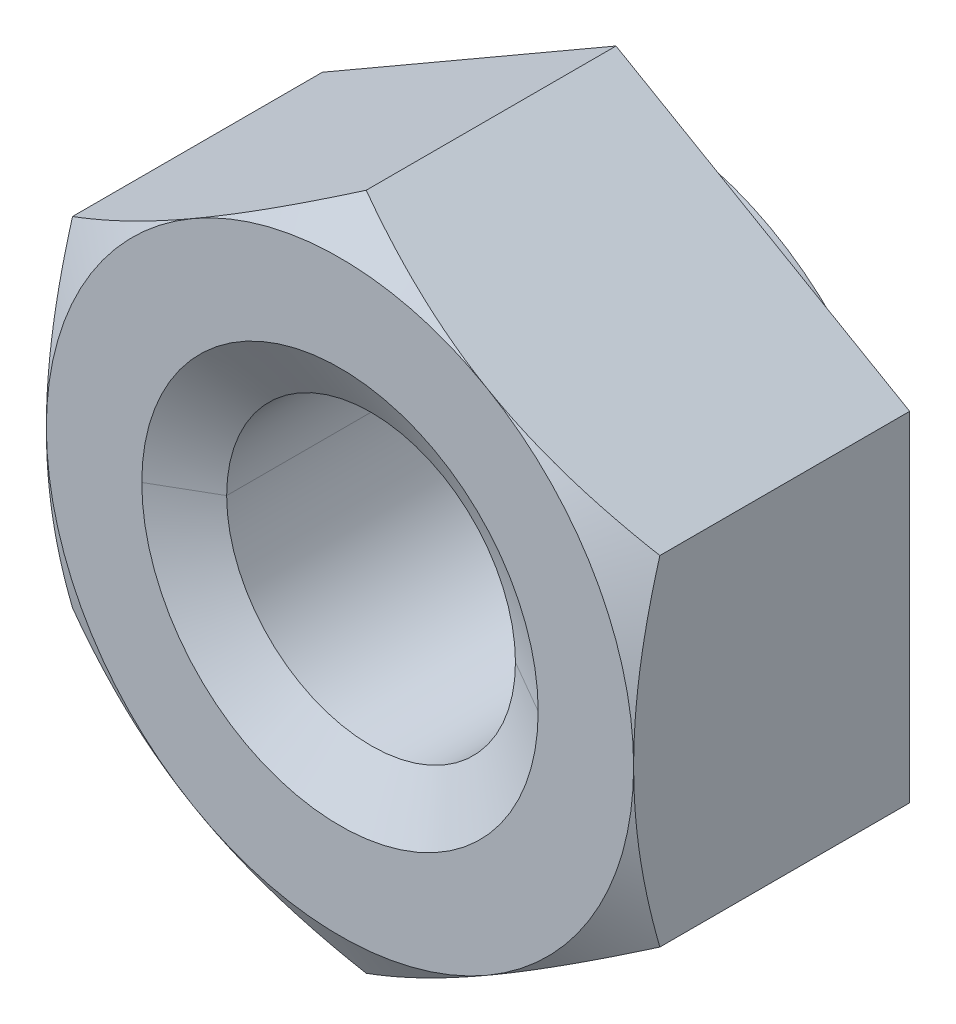
ISO-10303-21;
HEADER;
FILE_DESCRIPTION(('STEP AP214'),'2;1');
FILE_NAME('part.step','',(''),(''),'','','');
FILE_SCHEMA(('AUTOMOTIVE_DESIGN { 1 0 10303 214 1 1 1 1 }'));
ENDSEC;
DATA;
#1=APPLICATION_CONTEXT('core data for automotive mechanical design processes');
#2=APPLICATION_PROTOCOL_DEFINITION('international standard','automotive_design',2000,#1);
#3=PRODUCT_CONTEXT('',#1,'mechanical');
#4=PRODUCT('Part','Part','',(#3));
#5=PRODUCT_RELATED_PRODUCT_CATEGORY('part','',(#4));
#6=PRODUCT_DEFINITION_FORMATION('','',#4);
#7=PRODUCT_DEFINITION_CONTEXT('part definition',#1,'design');
#8=PRODUCT_DEFINITION('design','',#6,#7);
#9=PRODUCT_DEFINITION_SHAPE('','',#8);
#10=(LENGTH_UNIT() NAMED_UNIT(*) SI_UNIT(.MILLI.,.METRE.));
#11=(NAMED_UNIT(*) PLANE_ANGLE_UNIT() SI_UNIT($,.RADIAN.));
#12=(NAMED_UNIT(*) SI_UNIT($,.STERADIAN.) SOLID_ANGLE_UNIT());
#13=UNCERTAINTY_MEASURE_WITH_UNIT(LENGTH_MEASURE(1.E-05),#10,'distance_accuracy_value','');
#14=(GEOMETRIC_REPRESENTATION_CONTEXT(3) GLOBAL_UNCERTAINTY_ASSIGNED_CONTEXT((#13)) GLOBAL_UNIT_ASSIGNED_CONTEXT((#10,
#11,#12)) REPRESENTATION_CONTEXT('',''));
#15=CARTESIAN_POINT('',(0.,0.,0.));
#16=DIRECTION('',(0.,0.,1.));
#17=DIRECTION('',(1.,0.,0.));
#18=AXIS2_PLACEMENT_3D('',#15,#16,#17);
#19=CARTESIAN_POINT('',(0.,-4.45,-4.7));
#20=DIRECTION('',(0.,0.,-1.));
#21=DIRECTION('',(0.,-1.,0.));
#22=AXIS2_PLACEMENT_3D('',#19,#20,#21);
#23=PLANE('',#22);
#24=CARTESIAN_POINT('',(0.,0.,-4.7));
#25=DIRECTION('',(0.,0.,1.));
#26=DIRECTION('',(1.,0.,0.));
#27=AXIS2_PLACEMENT_3D('',#24,#25,#26);
#28=CIRCLE('',#27,4.45);
#29=CARTESIAN_POINT('',(4.45,0.,-4.7));
#30=VERTEX_POINT('',#29);
#31=CARTESIAN_POINT('',(-4.45,0.,-4.7));
#32=VERTEX_POINT('',#31);
#33=EDGE_CURVE('E336',#30,#32,#28,.T.);
#34=ORIENTED_EDGE('',*,*,#33,.T.);
#35=CARTESIAN_POINT('',(0.,0.,-4.7));
#36=DIRECTION('',(0.,0.,1.));
#37=DIRECTION('',(1.,0.,0.));
#38=AXIS2_PLACEMENT_3D('',#35,#36,#37);
#39=CIRCLE('',#38,4.45);
#40=EDGE_CURVE('E11',#32,#30,#39,.T.);
#41=ORIENTED_EDGE('',*,*,#40,.T.);
#42=EDGE_LOOP('',(#34,#41));
#43=FACE_BOUND('',#42,.T.);
#44=DIRECTION('',(0.,1.,0.));
#45=VECTOR('',#44,1.);
#46=CARTESIAN_POINT('',(5.,-2.8867513459481,-4.7));
#47=LINE('',#46,#45);
#48=CARTESIAN_POINT('',(5.00000000000006,-2.88675134594807,-4.7));
#49=VERTEX_POINT('',#48);
#50=CARTESIAN_POINT('',(5.,2.88675134594817,-4.7));
#51=VERTEX_POINT('',#50);
#52=EDGE_CURVE('E503',#49,#51,#47,.T.);
#53=ORIENTED_EDGE('',*,*,#52,.F.);
#54=DIRECTION('',(0.866025403784439,0.5,0.));
#55=VECTOR('',#54,1.);
#56=CARTESIAN_POINT('',(0.,-5.77350269189623,-4.7));
#57=LINE('',#56,#55);
#58=CARTESIAN_POINT('',(0.,-5.77350269189628,-4.7));
#59=VERTEX_POINT('',#58);
#60=EDGE_CURVE('E204',#59,#49,#57,.T.);
#61=ORIENTED_EDGE('',*,*,#60,.F.);
#62=DIRECTION('',(0.866025403784439,-0.5,0.));
#63=VECTOR('',#62,1.);
#64=CARTESIAN_POINT('',(-5.,-2.8867513459481,-4.7));
#65=LINE('',#64,#63);
#66=CARTESIAN_POINT('',(-5.,-2.88675134594819,-4.7));
#67=VERTEX_POINT('',#66);
#68=EDGE_CURVE('E300',#67,#59,#65,.T.);
#69=ORIENTED_EDGE('',*,*,#68,.F.);
#70=DIRECTION('',(0.,-1.,0.));
#71=VECTOR('',#70,1.);
#72=CARTESIAN_POINT('',(-5.,2.88675134594815,-4.7));
#73=LINE('',#72,#71);
#74=CARTESIAN_POINT('',(-5.,2.88675134594815,-4.7));
#75=VERTEX_POINT('',#74);
#76=EDGE_CURVE('E143',#75,#67,#73,.T.);
#77=ORIENTED_EDGE('',*,*,#76,.F.);
#78=DIRECTION('',(-0.866025403784439,-0.5,0.));
#79=VECTOR('',#78,1.);
#80=CARTESIAN_POINT('',(0.,5.77350269189628,-4.7));
#81=LINE('',#80,#79);
#82=CARTESIAN_POINT('',(0.,5.77350269189628,-4.7));
#83=VERTEX_POINT('',#82);
#84=EDGE_CURVE('E475',#83,#75,#81,.T.);
#85=ORIENTED_EDGE('',*,*,#84,.F.);
#86=DIRECTION('',(-0.866025403784439,0.5,0.));
#87=VECTOR('',#86,1.);
#88=CARTESIAN_POINT('',(5.,2.88675134594815,-4.7));
#89=LINE('',#88,#87);
#90=EDGE_CURVE('E326',#51,#83,#89,.T.);
#91=ORIENTED_EDGE('',*,*,#90,.F.);
#92=EDGE_LOOP('',(#53,#61,#69,#77,#85,#91));
#93=FACE_BOUND('',#92,.T.);
#94=ADVANCED_FACE('F17',(#43,#93),#23,.T.);
#95=CARTESIAN_POINT('',(0.,0.,0.));
#96=DIRECTION('',(0.,0.,1.));
#97=DIRECTION('',(1.,0.,0.));
#98=AXIS2_PLACEMENT_3D('',#95,#96,#97);
#99=CYLINDRICAL_SURFACE('',#98,4.45);
#100=DIRECTION('',(0.,0.,1.));
#101=VECTOR('',#100,1.);
#102=CARTESIAN_POINT('',(-4.45,0.,0.));
#103=LINE('',#102,#101);
#104=CARTESIAN_POINT('',(-4.45,0.,-5.2));
#105=VERTEX_POINT('',#104);
#106=EDGE_CURVE('E322',#105,#32,#103,.T.);
#107=ORIENTED_EDGE('',*,*,#106,.F.);
#108=CARTESIAN_POINT('',(0.,0.,-5.2));
#109=DIRECTION('',(0.,0.,1.));
#110=DIRECTION('',(1.,0.,0.));
#111=AXIS2_PLACEMENT_3D('',#108,#109,#110);
#112=CIRCLE('',#111,4.45);
#113=CARTESIAN_POINT('',(4.45,0.,-5.2));
#114=VERTEX_POINT('',#113);
#115=EDGE_CURVE('E95',#105,#114,#112,.T.);
#116=ORIENTED_EDGE('',*,*,#115,.T.);
#117=DIRECTION('',(0.,0.,1.));
#118=VECTOR('',#117,1.);
#119=CARTESIAN_POINT('',(4.45,0.,0.));
#120=LINE('',#119,#118);
#121=EDGE_CURVE('E332',#114,#30,#120,.T.);
#122=ORIENTED_EDGE('',*,*,#121,.T.);
#123=ORIENTED_EDGE('',*,*,#40,.F.);
#124=EDGE_LOOP('',(#107,#116,#122,#123));
#125=FACE_BOUND('',#124,.T.);
#126=ADVANCED_FACE('F397',(#125),#99,.T.);
#127=CARTESIAN_POINT('',(0.,0.,0.));
#128=DIRECTION('',(0.,0.,-1.));
#129=DIRECTION('',(1.,0.,0.));
#130=AXIS2_PLACEMENT_3D('',#127,#128,#129);
#131=CONICAL_SURFACE('',#130,5.,1.0471975511966);
#132=CARTESIAN_POINT('',(0.,0.,0.));
#133=DIRECTION('',(0.,0.,1.));
#134=DIRECTION('',(1.,0.,0.));
#135=AXIS2_PLACEMENT_3D('',#132,#133,#134);
#136=CIRCLE('',#135,5.);
#137=CARTESIAN_POINT('',(5.,0.,0.));
#138=VERTEX_POINT('',#137);
#139=CARTESIAN_POINT('',(2.5,4.33012701892222,0.));
#140=VERTEX_POINT('',#139);
#141=EDGE_CURVE('E180',#138,#140,#136,.T.);
#142=ORIENTED_EDGE('',*,*,#141,.F.);
#143=CARTESIAN_POINT('',(5.,2.88675134594815,-0.44658198738521));
#144=CARTESIAN_POINT('',(5.,2.13978985190511,-0.23095277755519));
#145=CARTESIAN_POINT('',(5.,1.4651498699089,-0.12138562684716));
#146=CARTESIAN_POINT('',(5.,0.717739751259445,0.));
#147=CARTESIAN_POINT('',(5.,0.,0.));
#148=B_SPLINE_CURVE_WITH_KNOTS('',2,(#143,#144,#145,#146,#147),.UNSPECIFIED.,.F.,.F.,(3,2,3),
(0.,0.5,1.),.UNSPECIFIED.);
#149=CARTESIAN_POINT('',(5.,2.88675134594815,-0.446581987385213));
#150=VERTEX_POINT('',#149);
#151=EDGE_CURVE('E506',#150,#138,#148,.T.);
#152=ORIENTED_EDGE('',*,*,#151,.F.);
#153=CARTESIAN_POINT('',(2.50000000000001,4.33012701892221,0.));
#154=CARTESIAN_POINT('',(3.11905581577512,3.97271497704105,0.));
#155=CARTESIAN_POINT('',(3.7644115070673,3.60011869495045,-0.12055357220658));
#156=CARTESIAN_POINT('',(4.35018566971069,3.26192182446397,-0.22997721062151));
#157=CARTESIAN_POINT('',(5.,2.88675134594815,-0.44658198738521));
#158=B_SPLINE_CURVE_WITH_KNOTS('',2,(#153,#154,#155,#156,#157),.UNSPECIFIED.,.F.,.F.,(3,2,3),
(0.,0.5,1.),.UNSPECIFIED.);
#159=EDGE_CURVE('E515',#140,#150,#158,.T.);
#160=ORIENTED_EDGE('',*,*,#159,.F.);
#161=EDGE_LOOP('',(#142,#152,#160));
#162=FACE_BOUND('',#161,.T.);
#163=ADVANCED_FACE('F395',(#162),#131,.T.);
#164=CARTESIAN_POINT('',(0.,0.,0.));
#165=DIRECTION('',(0.,0.,-1.));
#166=DIRECTION('',(1.,0.,0.));
#167=AXIS2_PLACEMENT_3D('',#164,#165,#166);
#168=CONICAL_SURFACE('',#167,5.,1.0471975511966);
#169=CARTESIAN_POINT('',(0.,0.,0.));
#170=DIRECTION('',(0.,0.,1.));
#171=DIRECTION('',(1.,0.,0.));
#172=AXIS2_PLACEMENT_3D('',#169,#170,#171);
#173=CIRCLE('',#172,5.);
#174=CARTESIAN_POINT('',(2.5,-4.33012701892217,0.));
#175=VERTEX_POINT('',#174);
#176=EDGE_CURVE('E160',#175,#138,#173,.T.);
#177=ORIENTED_EDGE('',*,*,#176,.F.);
#178=CARTESIAN_POINT('',(5.00000000000001,-2.8867513459481,-0.44658198738519));
#179=CARTESIAN_POINT('',(3.66025403784801,-3.66025403784227,0.));
#180=CARTESIAN_POINT('',(2.49999999999999,-4.33012701892217,0.));
#181=B_SPLINE_CURVE_WITH_KNOTS('',2,(#178,#179,#180),.UNSPECIFIED.,.F.,.F.,(3,3),(0.,1.),.UNSPECIFIED.);
#182=CARTESIAN_POINT('',(5.,-2.8867513459481,-0.446581987385198));
#183=VERTEX_POINT('',#182);
#184=EDGE_CURVE('E173',#183,#175,#181,.T.);
#185=ORIENTED_EDGE('',*,*,#184,.F.);
#186=CARTESIAN_POINT('',(5.,0.,0.));
#187=CARTESIAN_POINT('',(5.,-0.712205067236649,0.));
#188=CARTESIAN_POINT('',(5.,-1.45445474002716,-0.11965506873743));
#189=CARTESIAN_POINT('',(5.,-2.13337570264538,-0.2291011721543));
#190=CARTESIAN_POINT('',(5.,-2.8867513459481,-0.44658198738519));
#191=B_SPLINE_CURVE_WITH_KNOTS('',2,(#186,#187,#188,#189,#190),.UNSPECIFIED.,.F.,.F.,(3,2,3),
(0.,0.5,1.),.UNSPECIFIED.);
#192=EDGE_CURVE('E176',#138,#183,#191,.T.);
#193=ORIENTED_EDGE('',*,*,#192,.F.);
#194=EDGE_LOOP('',(#177,#185,#193));
#195=FACE_BOUND('',#194,.T.);
#196=ADVANCED_FACE('F171',(#195),#168,.T.);
#197=CARTESIAN_POINT('',(0.,0.,0.));
#198=DIRECTION('',(0.,0.,-1.));
#199=DIRECTION('',(1.,0.,0.));
#200=AXIS2_PLACEMENT_3D('',#197,#198,#199);
#201=CONICAL_SURFACE('',#200,5.,1.0471975511966);
#202=CARTESIAN_POINT('',(0.,0.,0.));
#203=DIRECTION('',(0.,0.,1.));
#204=DIRECTION('',(1.,0.,0.));
#205=AXIS2_PLACEMENT_3D('',#202,#203,#204);
#206=CIRCLE('',#205,5.);
#207=CARTESIAN_POINT('',(-2.5,-4.33012701892217,0.));
#208=VERTEX_POINT('',#207);
#209=EDGE_CURVE('E155',#208,#175,#206,.T.);
#210=ORIENTED_EDGE('',*,*,#209,.F.);
#211=CARTESIAN_POINT('',(0.,-5.77350269189623,-0.446581987385188));
#212=CARTESIAN_POINT('',(-1.33974596215199,-5.00000000000207,0.));
#213=CARTESIAN_POINT('',(-2.49999999999999,-4.33012701892217,0.));
#214=B_SPLINE_CURVE_WITH_KNOTS('',2,(#211,#212,#213),.UNSPECIFIED.,.F.,.F.,(3,3),(0.,1.),.UNSPECIFIED.);
#215=CARTESIAN_POINT('',(0.,-5.77350269189623,-0.446581987385191));
#216=VERTEX_POINT('',#215);
#217=EDGE_CURVE('E188',#216,#208,#214,.T.);
#218=ORIENTED_EDGE('',*,*,#217,.F.);
#219=CARTESIAN_POINT('',(2.49999999999999,-4.33012701892217,0.));
#220=CARTESIAN_POINT('',(1.88094418422114,-4.68753906080549,0.));
#221=CARTESIAN_POINT('',(1.2355884929327,-5.06013534289393,-0.12055357220655));
#222=CARTESIAN_POINT('',(0.649814330285145,-5.39833221338283,-0.22997721062288));
#223=CARTESIAN_POINT('',(0.,-5.77350269189623,-0.44658198738519));
#224=B_SPLINE_CURVE_WITH_KNOTS('',2,(#219,#220,#221,#222,#223),.UNSPECIFIED.,.F.,.F.,(3,2,3),
(0.,0.5,1.),.UNSPECIFIED.);
#225=EDGE_CURVE('E184',#175,#216,#224,.T.);
#226=ORIENTED_EDGE('',*,*,#225,.F.);
#227=EDGE_LOOP('',(#210,#218,#226));
#228=FACE_BOUND('',#227,.T.);
#229=ADVANCED_FACE('F186',(#228),#201,.T.);
#230=CARTESIAN_POINT('',(0.,0.,0.));
#231=DIRECTION('',(0.,0.,-1.));
#232=DIRECTION('',(1.,0.,0.));
#233=AXIS2_PLACEMENT_3D('',#230,#231,#232);
#234=CONICAL_SURFACE('',#233,5.,1.0471975511966);
#235=CARTESIAN_POINT('',(0.,0.,0.));
#236=DIRECTION('',(0.,0.,1.));
#237=DIRECTION('',(1.,0.,0.));
#238=AXIS2_PLACEMENT_3D('',#235,#236,#237);
#239=CIRCLE('',#238,5.);
#240=CARTESIAN_POINT('',(-5.,0.,0.));
#241=VERTEX_POINT('',#240);
#242=EDGE_CURVE('E162',#241,#208,#239,.T.);
#243=ORIENTED_EDGE('',*,*,#242,.F.);
#244=CARTESIAN_POINT('',(-5.,-2.8867513459481,-0.44658198738519));
#245=CARTESIAN_POINT('',(-5.,-2.13396938009111,-0.229272552070849));
#246=CARTESIAN_POINT('',(-5.,-1.45445474002717,-0.11965506873743));
#247=CARTESIAN_POINT('',(-5.,-0.712717487059665,0.));
#248=CARTESIAN_POINT('',(-5.,0.,0.));
#249=B_SPLINE_CURVE_WITH_KNOTS('',2,(#244,#245,#246,#247,#248),.UNSPECIFIED.,.F.,.F.,(3,2,3),
(0.,0.5,1.),.UNSPECIFIED.);
#250=CARTESIAN_POINT('',(-5.,-2.8867513459481,-0.446581987385196));
#251=VERTEX_POINT('',#250);
#252=EDGE_CURVE('E293',#251,#241,#249,.T.);
#253=ORIENTED_EDGE('',*,*,#252,.F.);
#254=CARTESIAN_POINT('',(-2.49999999999999,-4.33012701892217,0.));
#255=CARTESIAN_POINT('',(-3.11905581577563,-3.97271497704071,0.));
#256=CARTESIAN_POINT('',(-3.76441150706729,-3.60011869495041,-0.120553572206548));
#257=CARTESIAN_POINT('',(-4.35018566971112,-3.26192182446366,-0.229977210621637));
#258=CARTESIAN_POINT('',(-5.,-2.8867513459481,-0.446581987385188));
#259=B_SPLINE_CURVE_WITH_KNOTS('',2,(#254,#255,#256,#257,#258),.UNSPECIFIED.,.F.,.F.,(3,2,3),
(0.,0.5,1.),.UNSPECIFIED.);
#260=EDGE_CURVE('E283',#208,#251,#259,.T.);
#261=ORIENTED_EDGE('',*,*,#260,.F.);
#262=EDGE_LOOP('',(#243,#253,#261));
#263=FACE_BOUND('',#262,.T.);
#264=ADVANCED_FACE('F223',(#263),#234,.T.);
#265=CARTESIAN_POINT('',(0.,0.,0.));
#266=DIRECTION('',(0.,0.,-1.));
#267=DIRECTION('',(1.,0.,0.));
#268=AXIS2_PLACEMENT_3D('',#265,#266,#267);
#269=CONICAL_SURFACE('',#268,5.,1.0471975511966);
#270=CARTESIAN_POINT('',(0.,0.,0.));
#271=DIRECTION('',(0.,0.,1.));
#272=DIRECTION('',(1.,0.,0.));
#273=AXIS2_PLACEMENT_3D('',#270,#271,#272);
#274=CIRCLE('',#273,5.);
#275=CARTESIAN_POINT('',(-2.5,4.33012701892221,0.));
#276=VERTEX_POINT('',#275);
#277=EDGE_CURVE('E45',#276,#241,#274,.T.);
#278=ORIENTED_EDGE('',*,*,#277,.F.);
#279=CARTESIAN_POINT('',(-5.,2.88675134594815,-0.44658198738521));
#280=CARTESIAN_POINT('',(-3.66025403784795,3.66025403784235,0.));
#281=CARTESIAN_POINT('',(-2.50000000000001,4.3301270189222,0.));
#282=B_SPLINE_CURVE_WITH_KNOTS('',2,(#279,#280,#281),.UNSPECIFIED.,.F.,.F.,(3,3),(0.,1.),.UNSPECIFIED.);
#283=CARTESIAN_POINT('',(-5.,2.88675134594815,-0.446581987385209));
#284=VERTEX_POINT('',#283);
#285=EDGE_CURVE('E412',#284,#276,#282,.T.);
#286=ORIENTED_EDGE('',*,*,#285,.F.);
#287=CARTESIAN_POINT('',(-5.,0.,0.));
#288=CARTESIAN_POINT('',(-5.,0.71722750229613,0.));
#289=CARTESIAN_POINT('',(-5.,1.46514986990889,-0.12138562684716));
#290=CARTESIAN_POINT('',(-5.,2.13919606130658,-0.230781364974239));
#291=CARTESIAN_POINT('',(-5.,2.88675134594815,-0.44658198738521));
#292=B_SPLINE_CURVE_WITH_KNOTS('',2,(#287,#288,#289,#290,#291),.UNSPECIFIED.,.F.,.F.,(3,2,3),
(0.,0.5,1.),.UNSPECIFIED.);
#293=EDGE_CURVE('E469',#241,#284,#292,.T.);
#294=ORIENTED_EDGE('',*,*,#293,.F.);
#295=EDGE_LOOP('',(#278,#286,#294));
#296=FACE_BOUND('',#295,.T.);
#297=ADVANCED_FACE('F418',(#296),#269,.T.);
#298=CARTESIAN_POINT('',(0.,0.,0.));
#299=DIRECTION('',(0.,0.,-1.));
#300=DIRECTION('',(1.,0.,0.));
#301=AXIS2_PLACEMENT_3D('',#298,#299,#300);
#302=CONICAL_SURFACE('',#301,5.,1.0471975511966);
#303=CARTESIAN_POINT('',(-2.50000000000001,4.3301270189222,0.));
#304=CARTESIAN_POINT('',(-1.88094418422101,4.68753906080561,0.));
#305=CARTESIAN_POINT('',(-1.23558849293271,5.06013534289397,-0.12055357220658));
#306=CARTESIAN_POINT('',(-0.649814330284845,5.39833221338305,-0.22997721062301));
#307=CARTESIAN_POINT('',(0.,5.77350269189628,-0.44658198738521));
#308=B_SPLINE_CURVE_WITH_KNOTS('',2,(#303,#304,#305,#306,#307),.UNSPECIFIED.,.F.,.F.,(3,2,3),
(0.,0.5,1.),.UNSPECIFIED.);
#309=CARTESIAN_POINT('',(0.,5.77350269189628,-0.446581987385218));
#310=VERTEX_POINT('',#309);
#311=EDGE_CURVE('E378',#276,#310,#308,.T.);
#312=ORIENTED_EDGE('',*,*,#311,.F.);
#313=CARTESIAN_POINT('',(0.,0.,0.));
#314=DIRECTION('',(0.,0.,1.));
#315=DIRECTION('',(1.,0.,0.));
#316=AXIS2_PLACEMENT_3D('',#313,#314,#315);
#317=CIRCLE('',#316,5.);
#318=EDGE_CURVE('E566',#140,#276,#317,.T.);
#319=ORIENTED_EDGE('',*,*,#318,.F.);
#320=CARTESIAN_POINT('',(0.,5.77350269189628,-0.44658198738521));
#321=CARTESIAN_POINT('',(1.33974596215207,5.00000000000207,0.));
#322=CARTESIAN_POINT('',(2.50000000000001,4.33012701892221,0.));
#323=B_SPLINE_CURVE_WITH_KNOTS('',2,(#320,#321,#322),.UNSPECIFIED.,.F.,.F.,(3,3),(0.,1.),.UNSPECIFIED.);
#324=EDGE_CURVE('E520',#310,#140,#323,.T.);
#325=ORIENTED_EDGE('',*,*,#324,.F.);
#326=EDGE_LOOP('',(#312,#319,#325));
#327=FACE_BOUND('',#326,.T.);
#328=ADVANCED_FACE('F427',(#327),#302,.T.);
#329=CARTESIAN_POINT('',(0.,0.,-5.2));
#330=DIRECTION('',(0.,0.,-1.));
#331=DIRECTION('',(-1.,0.,0.));
#332=AXIS2_PLACEMENT_3D('',#329,#330,#331);
#333=CONICAL_SURFACE('',#332,3.375,1.0471975511966);
#334=DIRECTION('',(0.866025403784439,0.,-0.5));
#335=VECTOR('',#334,1.);
#336=CARTESIAN_POINT('',(3.375,0.,-5.2));
#337=LINE('',#336,#335);
#338=CARTESIAN_POINT('',(2.45875,0.,-4.67100281585501));
#339=VERTEX_POINT('',#338);
#340=CARTESIAN_POINT('',(3.375,0.,-5.2));
#341=VERTEX_POINT('',#340);
#342=EDGE_CURVE('E342',#339,#341,#337,.T.);
#343=ORIENTED_EDGE('',*,*,#342,.F.);
#344=CARTESIAN_POINT('',(0.,0.,-4.67100281585501));
#345=DIRECTION('',(0.,0.,1.));
#346=DIRECTION('',(1.,0.,0.));
#347=AXIS2_PLACEMENT_3D('',#344,#345,#346);
#348=CIRCLE('',#347,2.45875);
#349=CARTESIAN_POINT('',(-2.45875,0.,-4.67100281585501));
#350=VERTEX_POINT('',#349);
#351=EDGE_CURVE('E323',#339,#350,#348,.T.);
#352=ORIENTED_EDGE('',*,*,#351,.T.);
#353=DIRECTION('',(-0.866025403784439,0.,-0.5));
#354=VECTOR('',#353,1.);
#355=CARTESIAN_POINT('',(-3.375,0.,-5.2));
#356=LINE('',#355,#354);
#357=CARTESIAN_POINT('',(-3.375,0.,-5.2));
#358=VERTEX_POINT('',#357);
#359=EDGE_CURVE('E353',#350,#358,#356,.T.);
#360=ORIENTED_EDGE('',*,*,#359,.T.);
#361=CARTESIAN_POINT('',(0.,0.,-5.2));
#362=DIRECTION('',(0.,0.,1.));
#363=DIRECTION('',(1.,0.,0.));
#364=AXIS2_PLACEMENT_3D('',#361,#362,#363);
#365=CIRCLE('',#364,3.375);
#366=EDGE_CURVE('E181',#341,#358,#365,.T.);
#367=ORIENTED_EDGE('',*,*,#366,.F.);
#368=EDGE_LOOP('',(#343,#352,#360,#367));
#369=FACE_BOUND('',#368,.T.);
#370=ADVANCED_FACE('F19',(#369),#333,.F.);
#371=CARTESIAN_POINT('',(0.,0.,-0.528997184144995));
#372=DIRECTION('',(0.,0.,1.));
#373=DIRECTION('',(1.,0.,0.));
#374=AXIS2_PLACEMENT_3D('',#371,#372,#373);
#375=CONICAL_SURFACE('',#374,2.45875,1.0471975511966);
#376=DIRECTION('',(-0.866025403784439,0.,0.5));
#377=VECTOR('',#376,1.);
#378=CARTESIAN_POINT('',(-2.45875,0.,-0.528997184144995));
#379=LINE('',#378,#377);
#380=CARTESIAN_POINT('',(-2.45875,0.,-0.528997184144995));
#381=VERTEX_POINT('',#380);
#382=CARTESIAN_POINT('',(-3.375,0.,0.));
#383=VERTEX_POINT('',#382);
#384=EDGE_CURVE('E358',#381,#383,#379,.T.);
#385=ORIENTED_EDGE('',*,*,#384,.F.);
#386=CARTESIAN_POINT('',(0.,0.,-0.528997184144995));
#387=DIRECTION('',(0.,0.,1.));
#388=DIRECTION('',(1.,0.,0.));
#389=AXIS2_PLACEMENT_3D('',#386,#387,#388);
#390=CIRCLE('',#389,2.45875);
#391=CARTESIAN_POINT('',(2.45875,0.,-0.528997184144995));
#392=VERTEX_POINT('',#391);
#393=EDGE_CURVE('E30',#392,#381,#390,.T.);
#394=ORIENTED_EDGE('',*,*,#393,.F.);
#395=DIRECTION('',(0.866025403784439,0.,0.5));
#396=VECTOR('',#395,1.);
#397=CARTESIAN_POINT('',(2.45875,0.,-0.528997184144995));
#398=LINE('',#397,#396);
#399=CARTESIAN_POINT('',(3.375,0.,0.));
#400=VERTEX_POINT('',#399);
#401=EDGE_CURVE('E369',#392,#400,#398,.T.);
#402=ORIENTED_EDGE('',*,*,#401,.T.);
#403=CARTESIAN_POINT('',(0.,0.,0.));
#404=DIRECTION('',(0.,0.,1.));
#405=DIRECTION('',(1.,0.,0.));
#406=AXIS2_PLACEMENT_3D('',#403,#404,#405);
#407=CIRCLE('',#406,3.375);
#408=EDGE_CURVE('E167',#400,#383,#407,.T.);
#409=ORIENTED_EDGE('',*,*,#408,.T.);
#410=EDGE_LOOP('',(#385,#394,#402,#409));
#411=FACE_BOUND('',#410,.T.);
#412=ADVANCED_FACE('F658',(#411),#375,.F.);
#413=CARTESIAN_POINT('',(0.,0.,-5.2));
#414=DIRECTION('',(0.,0.,1.));
#415=DIRECTION('',(1.,0.,0.));
#416=AXIS2_PLACEMENT_3D('',#413,#414,#415);
#417=CYLINDRICAL_SURFACE('',#416,2.45875);
#418=DIRECTION('',(0.,0.,1.));
#419=VECTOR('',#418,1.);
#420=CARTESIAN_POINT('',(-2.45875,0.,-5.2));
#421=LINE('',#420,#419);
#422=EDGE_CURVE('E347',#350,#381,#421,.T.);
#423=ORIENTED_EDGE('',*,*,#422,.F.);
#424=ORIENTED_EDGE('',*,*,#351,.F.);
#425=DIRECTION('',(0.,0.,1.));
#426=VECTOR('',#425,1.);
#427=CARTESIAN_POINT('',(2.45875,0.,-5.2));
#428=LINE('',#427,#426);
#429=EDGE_CURVE('E343',#339,#392,#428,.T.);
#430=ORIENTED_EDGE('',*,*,#429,.T.);
#431=ORIENTED_EDGE('',*,*,#393,.T.);
#432=EDGE_LOOP('',(#423,#424,#430,#431));
#433=FACE_BOUND('',#432,.T.);
#434=ADVANCED_FACE('F459',(#433),#417,.F.);
#435=CARTESIAN_POINT('',(0.,5.77350269189628,0.));
#436=DIRECTION('',(0.,0.,1.));
#437=DIRECTION('',(1.,0.,0.));
#438=AXIS2_PLACEMENT_3D('',#435,#436,#437);
#439=PLANE('',#438);
#440=ORIENTED_EDGE('',*,*,#408,.F.);
#441=CARTESIAN_POINT('',(0.,0.,0.));
#442=DIRECTION('',(0.,0.,1.));
#443=DIRECTION('',(1.,0.,0.));
#444=AXIS2_PLACEMENT_3D('',#441,#442,#443);
#445=CIRCLE('',#444,3.375);
#446=EDGE_CURVE('E362',#383,#400,#445,.T.);
#447=ORIENTED_EDGE('',*,*,#446,.F.);
#448=EDGE_LOOP('',(#440,#447));
#449=FACE_BOUND('',#448,.T.);
#450=ORIENTED_EDGE('',*,*,#176,.T.);
#451=ORIENTED_EDGE('',*,*,#141,.T.);
#452=ORIENTED_EDGE('',*,*,#318,.T.);
#453=ORIENTED_EDGE('',*,*,#277,.T.);
#454=ORIENTED_EDGE('',*,*,#242,.T.);
#455=ORIENTED_EDGE('',*,*,#209,.T.);
#456=EDGE_LOOP('',(#450,#451,#452,#453,#454,#455));
#457=FACE_BOUND('',#456,.T.);
#458=ADVANCED_FACE('F157',(#449,#457),#439,.T.);
#459=CARTESIAN_POINT('',(0.,5.77350269189628,-5.2));
#460=DIRECTION('',(0.,0.,1.));
#461=DIRECTION('',(1.,0.,0.));
#462=AXIS2_PLACEMENT_3D('',#459,#460,#461);
#463=PLANE('',#462);
#464=CARTESIAN_POINT('',(0.,0.,-5.2));
#465=DIRECTION('',(0.,0.,1.));
#466=DIRECTION('',(1.,0.,0.));
#467=AXIS2_PLACEMENT_3D('',#464,#465,#466);
#468=CIRCLE('',#467,3.375);
#469=EDGE_CURVE('E316',#358,#341,#468,.T.);
#470=ORIENTED_EDGE('',*,*,#469,.T.);
#471=ORIENTED_EDGE('',*,*,#366,.T.);
#472=EDGE_LOOP('',(#470,#471));
#473=FACE_BOUND('',#472,.T.);
#474=CARTESIAN_POINT('',(0.,0.,-5.2));
#475=DIRECTION('',(0.,0.,1.));
#476=DIRECTION('',(1.,0.,0.));
#477=AXIS2_PLACEMENT_3D('',#474,#475,#476);
#478=CIRCLE('',#477,4.45);
#479=EDGE_CURVE('E318',#114,#105,#478,.T.);
#480=ORIENTED_EDGE('',*,*,#479,.F.);
#481=ORIENTED_EDGE('',*,*,#115,.F.);
#482=EDGE_LOOP('',(#480,#481));
#483=FACE_BOUND('',#482,.T.);
#484=ADVANCED_FACE('F394',(#473,#483),#463,.F.);
#485=CARTESIAN_POINT('',(0.,5.77350269189628,-5.2));
#486=DIRECTION('',(-0.5,0.866025403784439,0.));
#487=DIRECTION('',(0.,0.,1.));
#488=AXIS2_PLACEMENT_3D('',#485,#486,#487);
#489=PLANE('',#488);
#490=DIRECTION('',(0.,0.,1.));
#491=VECTOR('',#490,1.);
#492=CARTESIAN_POINT('',(0.,5.77350269189628,-5.2));
#493=LINE('',#492,#491);
#494=EDGE_CURVE('E330',#83,#310,#493,.T.);
#495=ORIENTED_EDGE('',*,*,#494,.F.);
#496=ORIENTED_EDGE('',*,*,#84,.T.);
#497=DIRECTION('',(0.,0.,1.));
#498=VECTOR('',#497,1.);
#499=CARTESIAN_POINT('',(-5.,2.88675134594815,-5.2));
#500=LINE('',#499,#498);
#501=EDGE_CURVE('E297',#75,#284,#500,.T.);
#502=ORIENTED_EDGE('',*,*,#501,.T.);
#503=ORIENTED_EDGE('',*,*,#285,.T.);
#504=ORIENTED_EDGE('',*,*,#311,.T.);
#505=EDGE_LOOP('',(#495,#496,#502,#503,#504));
#506=FACE_BOUND('',#505,.T.);
#507=ADVANCED_FACE('F385',(#506),#489,.T.);
#508=CARTESIAN_POINT('',(-5.,2.88675134594815,-5.2));
#509=DIRECTION('',(-1.,0.,0.));
#510=DIRECTION('',(0.,0.,1.));
#511=AXIS2_PLACEMENT_3D('',#508,#509,#510);
#512=PLANE('',#511);
#513=ORIENTED_EDGE('',*,*,#501,.F.);
#514=ORIENTED_EDGE('',*,*,#76,.T.);
#515=DIRECTION('',(0.,0.,1.));
#516=VECTOR('',#515,1.);
#517=CARTESIAN_POINT('',(-5.,-2.8867513459481,-5.2));
#518=LINE('',#517,#516);
#519=EDGE_CURVE('E195',#67,#251,#518,.T.);
#520=ORIENTED_EDGE('',*,*,#519,.T.);
#521=ORIENTED_EDGE('',*,*,#252,.T.);
#522=ORIENTED_EDGE('',*,*,#293,.T.);
#523=EDGE_LOOP('',(#513,#514,#520,#521,#522));
#524=FACE_BOUND('',#523,.T.);
#525=ADVANCED_FACE('F263',(#524),#512,.T.);
#526=CARTESIAN_POINT('',(-5.,-2.8867513459481,-5.2));
#527=DIRECTION('',(-0.5,-0.866025403784439,0.));
#528=DIRECTION('',(-0.866025403784439,0.5,0.));
#529=AXIS2_PLACEMENT_3D('',#526,#527,#528);
#530=PLANE('',#529);
#531=ORIENTED_EDGE('',*,*,#519,.F.);
#532=ORIENTED_EDGE('',*,*,#68,.T.);
#533=DIRECTION('',(0.,0.,1.));
#534=VECTOR('',#533,1.);
#535=CARTESIAN_POINT('',(0.,-5.77350269189623,-5.2));
#536=LINE('',#535,#534);
#537=EDGE_CURVE('E239',#59,#216,#536,.T.);
#538=ORIENTED_EDGE('',*,*,#537,.T.);
#539=ORIENTED_EDGE('',*,*,#217,.T.);
#540=ORIENTED_EDGE('',*,*,#260,.T.);
#541=EDGE_LOOP('',(#531,#532,#538,#539,#540));
#542=FACE_BOUND('',#541,.T.);
#543=ADVANCED_FACE('F222',(#542),#530,.T.);
#544=CARTESIAN_POINT('',(0.,-5.77350269189623,-5.2));
#545=DIRECTION('',(0.5,-0.866025403784439,0.));
#546=DIRECTION('',(0.,0.,-1.));
#547=AXIS2_PLACEMENT_3D('',#544,#545,#546);
#548=PLANE('',#547);
#549=ORIENTED_EDGE('',*,*,#537,.F.);
#550=ORIENTED_EDGE('',*,*,#60,.T.);
#551=DIRECTION('',(0.,0.,1.));
#552=VECTOR('',#551,1.);
#553=CARTESIAN_POINT('',(5.,-2.8867513459481,-5.2));
#554=LINE('',#553,#552);
#555=EDGE_CURVE('E202',#49,#183,#554,.T.);
#556=ORIENTED_EDGE('',*,*,#555,.T.);
#557=ORIENTED_EDGE('',*,*,#184,.T.);
#558=ORIENTED_EDGE('',*,*,#225,.T.);
#559=EDGE_LOOP('',(#549,#550,#556,#557,#558));
#560=FACE_BOUND('',#559,.T.);
#561=ADVANCED_FACE('F200',(#560),#548,.T.);
#562=CARTESIAN_POINT('',(5.,-2.8867513459481,-5.2));
#563=DIRECTION('',(1.,0.,0.));
#564=DIRECTION('',(0.,1.,0.));
#565=AXIS2_PLACEMENT_3D('',#562,#563,#564);
#566=PLANE('',#565);
#567=ORIENTED_EDGE('',*,*,#555,.F.);
#568=ORIENTED_EDGE('',*,*,#52,.T.);
#569=DIRECTION('',(0.,0.,1.));
#570=VECTOR('',#569,1.);
#571=CARTESIAN_POINT('',(5.,2.88675134594815,-5.2));
#572=LINE('',#571,#570);
#573=EDGE_CURVE('E331',#51,#150,#572,.T.);
#574=ORIENTED_EDGE('',*,*,#573,.T.);
#575=ORIENTED_EDGE('',*,*,#151,.T.);
#576=ORIENTED_EDGE('',*,*,#192,.T.);
#577=EDGE_LOOP('',(#567,#568,#574,#575,#576));
#578=FACE_BOUND('',#577,.T.);
#579=ADVANCED_FACE('F221',(#578),#566,.T.);
#580=CARTESIAN_POINT('',(5.,2.88675134594815,-5.2));
#581=DIRECTION('',(0.5,0.866025403784439,0.));
#582=DIRECTION('',(0.,0.,-1.));
#583=AXIS2_PLACEMENT_3D('',#580,#581,#582);
#584=PLANE('',#583);
#585=ORIENTED_EDGE('',*,*,#573,.F.);
#586=ORIENTED_EDGE('',*,*,#90,.T.);
#587=ORIENTED_EDGE('',*,*,#494,.T.);
#588=ORIENTED_EDGE('',*,*,#324,.T.);
#589=ORIENTED_EDGE('',*,*,#159,.T.);
#590=EDGE_LOOP('',(#585,#586,#587,#588,#589));
#591=FACE_BOUND('',#590,.T.);
#592=ADVANCED_FACE('F265',(#591),#584,.T.);
#593=CARTESIAN_POINT('',(0.,0.,-5.2));
#594=DIRECTION('',(0.,0.,1.));
#595=DIRECTION('',(1.,0.,0.));
#596=AXIS2_PLACEMENT_3D('',#593,#594,#595);
#597=CYLINDRICAL_SURFACE('',#596,2.45875);
#598=CARTESIAN_POINT('',(0.,0.,-4.67100281585501));
#599=DIRECTION('',(0.,0.,1.));
#600=DIRECTION('',(1.,0.,0.));
#601=AXIS2_PLACEMENT_3D('',#598,#599,#600);
#602=CIRCLE('',#601,2.45875);
#603=EDGE_CURVE('E335',#350,#339,#602,.T.);
#604=ORIENTED_EDGE('',*,*,#603,.F.);
#605=ORIENTED_EDGE('',*,*,#422,.T.);
#606=CARTESIAN_POINT('',(0.,0.,-0.528997184144995));
#607=DIRECTION('',(0.,0.,1.));
#608=DIRECTION('',(1.,0.,0.));
#609=AXIS2_PLACEMENT_3D('',#606,#607,#608);
#610=CIRCLE('',#609,2.45875);
#611=EDGE_CURVE('E357',#381,#392,#610,.T.);
#612=ORIENTED_EDGE('',*,*,#611,.T.);
#613=ORIENTED_EDGE('',*,*,#429,.F.);
#614=EDGE_LOOP('',(#604,#605,#612,#613));
#615=FACE_BOUND('',#614,.T.);
#616=ADVANCED_FACE('F554',(#615),#597,.F.);
#617=CARTESIAN_POINT('',(0.,0.,-0.528997184144995));
#618=DIRECTION('',(0.,0.,1.));
#619=DIRECTION('',(1.,0.,0.));
#620=AXIS2_PLACEMENT_3D('',#617,#618,#619);
#621=CONICAL_SURFACE('',#620,2.45875,1.0471975511966);
#622=ORIENTED_EDGE('',*,*,#611,.F.);
#623=ORIENTED_EDGE('',*,*,#384,.T.);
#624=ORIENTED_EDGE('',*,*,#446,.T.);
#625=ORIENTED_EDGE('',*,*,#401,.F.);
#626=EDGE_LOOP('',(#622,#623,#624,#625));
#627=FACE_BOUND('',#626,.T.);
#628=ADVANCED_FACE('F669',(#627),#621,.F.);
#629=CARTESIAN_POINT('',(0.,0.,-5.2));
#630=DIRECTION('',(0.,0.,-1.));
#631=DIRECTION('',(-1.,0.,0.));
#632=AXIS2_PLACEMENT_3D('',#629,#630,#631);
#633=CONICAL_SURFACE('',#632,3.375,1.0471975511966);
#634=ORIENTED_EDGE('',*,*,#603,.T.);
#635=ORIENTED_EDGE('',*,*,#342,.T.);
#636=ORIENTED_EDGE('',*,*,#469,.F.);
#637=ORIENTED_EDGE('',*,*,#359,.F.);
#638=EDGE_LOOP('',(#634,#635,#636,#637));
#639=FACE_BOUND('',#638,.T.);
#640=ADVANCED_FACE('F673',(#639),#633,.F.);
#641=CARTESIAN_POINT('',(0.,0.,0.));
#642=DIRECTION('',(0.,0.,1.));
#643=DIRECTION('',(1.,0.,0.));
#644=AXIS2_PLACEMENT_3D('',#641,#642,#643);
#645=CYLINDRICAL_SURFACE('',#644,4.45);
#646=ORIENTED_EDGE('',*,*,#479,.T.);
#647=ORIENTED_EDGE('',*,*,#106,.T.);
#648=ORIENTED_EDGE('',*,*,#33,.F.);
#649=ORIENTED_EDGE('',*,*,#121,.F.);
#650=EDGE_LOOP('',(#646,#647,#648,#649));
#651=FACE_BOUND('',#650,.T.);
#652=ADVANCED_FACE('F684',(#651),#645,.T.);
#653=CLOSED_SHELL('',(#94,#126,#163,#196,#229,#264,#297,#328,#370,#412,#434,#458,#484,#507,#525,
#543,#561,#579,#592,#616,#628,#640,#652));
#654=MANIFOLD_SOLID_BREP('B1',#653);
#655=ADVANCED_BREP_SHAPE_REPRESENTATION('',(#18,#654),#14);
#656=SHAPE_DEFINITION_REPRESENTATION(#9,#655);
ENDSEC;
END-ISO-10303-21;
